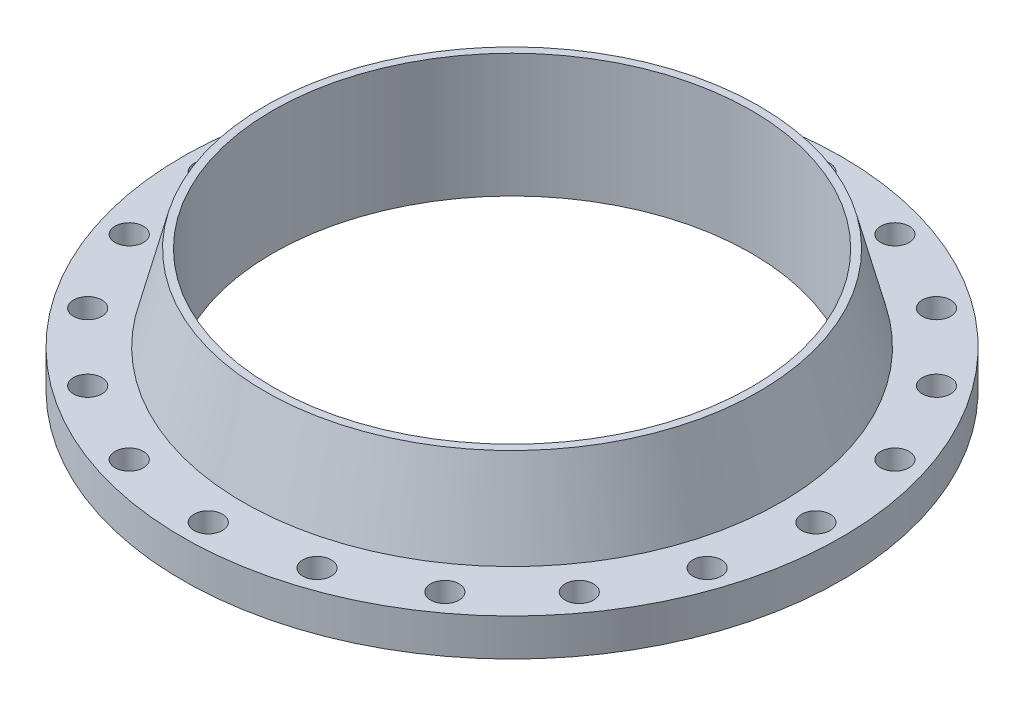
ISO-10303-21;
HEADER;
FILE_DESCRIPTION(('STEP AP214'),'2;1');
FILE_NAME('part.step','',(''),(''),'','','');
FILE_SCHEMA(('AUTOMOTIVE_DESIGN { 1 0 10303 214 1 1 1 1 }'));
ENDSEC;
DATA;
#1=APPLICATION_CONTEXT('core data for automotive mechanical design processes');
#2=APPLICATION_PROTOCOL_DEFINITION('international standard','automotive_design',2000,#1);
#3=PRODUCT_CONTEXT('',#1,'mechanical');
#4=PRODUCT('Part','Part','',(#3));
#5=PRODUCT_RELATED_PRODUCT_CATEGORY('part','',(#4));
#6=PRODUCT_DEFINITION_FORMATION('','',#4);
#7=PRODUCT_DEFINITION_CONTEXT('part definition',#1,'design');
#8=PRODUCT_DEFINITION('design','',#6,#7);
#9=PRODUCT_DEFINITION_SHAPE('','',#8);
#10=(LENGTH_UNIT() NAMED_UNIT(*) SI_UNIT(.MILLI.,.METRE.));
#11=(NAMED_UNIT(*) PLANE_ANGLE_UNIT() SI_UNIT($,.RADIAN.));
#12=(NAMED_UNIT(*) SI_UNIT($,.STERADIAN.) SOLID_ANGLE_UNIT());
#13=UNCERTAINTY_MEASURE_WITH_UNIT(LENGTH_MEASURE(1.E-05),#10,'distance_accuracy_value','');
#14=(GEOMETRIC_REPRESENTATION_CONTEXT(3) GLOBAL_UNCERTAINTY_ASSIGNED_CONTEXT((#13)) GLOBAL_UNIT_ASSIGNED_CONTEXT((#10,
#11,#12)) REPRESENTATION_CONTEXT('',''));
#15=CARTESIAN_POINT('',(0.,0.,0.));
#16=DIRECTION('',(0.,0.,1.));
#17=DIRECTION('',(1.,0.,0.));
#18=AXIS2_PLACEMENT_3D('',#15,#16,#17);
#19=CARTESIAN_POINT('',(-295.275,-42.5532702018429,-1.07742661903022E-13));
#20=DIRECTION('',(0.,1.,0.));
#21=DIRECTION('',(0.,0.,1.));
#22=AXIS2_PLACEMENT_3D('',#19,#20,#21);
#23=PLANE('',#22);
#24=CARTESIAN_POINT('',(0.,-42.5532702018429,-1.07742661903022E-13));
#25=DIRECTION('',(0.,-1.,0.));
#26=DIRECTION('',(0.,0.,-1.));
#27=AXIS2_PLACEMENT_3D('',#24,#25,#26);
#28=CIRCLE('',#27,295.275);
#29=CARTESIAN_POINT('',(0.,-42.5532702018429,-295.275));
#30=VERTEX_POINT('',#29);
#31=EDGE_CURVE('E10',#30,#30,#28,.T.);
#32=ORIENTED_EDGE('',*,*,#31,.F.);
#33=EDGE_LOOP('',(#32));
#34=FACE_BOUND('',#33,.T.);
#35=CARTESIAN_POINT('',(0.,-42.5532702018429,-1.07742661903022E-13));
#36=DIRECTION('',(0.,-1.,0.));
#37=DIRECTION('',(0.,0.,-1.));
#38=AXIS2_PLACEMENT_3D('',#35,#36,#37);
#39=CIRCLE('',#38,346.075);
#40=CARTESIAN_POINT('',(0.,-42.5532702018429,-346.075));
#41=VERTEX_POINT('',#40);
#42=EDGE_CURVE('E41',#41,#41,#39,.T.);
#43=ORIENTED_EDGE('',*,*,#42,.T.);
#44=EDGE_LOOP('',(#43));
#45=FACE_BOUND('',#44,.T.);
#46=ADVANCED_FACE('F34',(#34,#45),#23,.F.);
#47=CARTESIAN_POINT('',(0.,-40.9657702018428,-1.07742661903022E-13));
#48=DIRECTION('',(0.,-1.,0.));
#49=DIRECTION('',(0.,0.,-1.));
#50=AXIS2_PLACEMENT_3D('',#47,#48,#49);
#51=CYLINDRICAL_SURFACE('',#50,346.075);
#52=ORIENTED_EDGE('',*,*,#42,.F.);
#53=EDGE_LOOP('',(#52));
#54=FACE_BOUND('',#53,.T.);
#55=CARTESIAN_POINT('',(0.,-40.9657702018429,-1.07742661903022E-13));
#56=DIRECTION('',(0.,-1.,0.));
#57=DIRECTION('',(0.,0.,-1.));
#58=AXIS2_PLACEMENT_3D('',#55,#56,#57);
#59=CIRCLE('',#58,346.075);
#60=CARTESIAN_POINT('',(0.,-40.9657702018429,-346.075));
#61=VERTEX_POINT('',#60);
#62=EDGE_CURVE('E46',#61,#61,#59,.T.);
#63=ORIENTED_EDGE('',*,*,#62,.T.);
#64=EDGE_LOOP('',(#63));
#65=FACE_BOUND('',#64,.T.);
#66=ADVANCED_FACE('F136',(#54,#65),#51,.T.);
#67=CARTESIAN_POINT('',(-346.075,-40.9657702018429,-1.07742661903022E-13));
#68=DIRECTION('',(0.,1.,0.));
#69=DIRECTION('',(0.,0.,1.));
#70=AXIS2_PLACEMENT_3D('',#67,#68,#69);
#71=PLANE('',#70);
#72=CARTESIAN_POINT('',(220.213744771376,-40.9657702018428,-303.098216942574));
#73=DIRECTION('',(0.,1.,0.));
#74=DIRECTION('',(-0.587785252292474,0.,0.809016994374947));
#75=AXIS2_PLACEMENT_3D('',#72,#73,#74);
#76=CIRCLE('',#75,17.526);
#77=CARTESIAN_POINT('',(209.912220439698,-40.9657702018428,-288.919385099159));
#78=VERTEX_POINT('',#77);
#79=EDGE_CURVE('E416',#78,#78,#76,.T.);
#80=ORIENTED_EDGE('',*,*,#79,.T.);
#81=EDGE_LOOP('',(#80));
#82=FACE_BOUND('',#81,.T.);
#83=CARTESIAN_POINT('',(303.098216942574,-40.9657702018428,-220.213744771374));
#84=DIRECTION('',(0.,1.,0.));
#85=DIRECTION('',(-0.809016994374949,0.,0.587785252292471));
#86=AXIS2_PLACEMENT_3D('',#83,#84,#85);
#87=CIRCLE('',#86,17.526);
#88=CARTESIAN_POINT('',(288.919385099159,-40.9657702018428,-209.912220439697));
#89=VERTEX_POINT('',#88);
#90=EDGE_CURVE('E417',#89,#89,#87,.T.);
#91=ORIENTED_EDGE('',*,*,#90,.T.);
#92=EDGE_LOOP('',(#91));
#93=FACE_BOUND('',#92,.T.);
#94=CARTESIAN_POINT('',(356.31332382998,-40.9657702018428,-115.773216942573));
#95=DIRECTION('',(0.,1.,0.));
#96=DIRECTION('',(-0.951056516295155,0.,0.309016994374945));
#97=AXIS2_PLACEMENT_3D('',#94,#95,#96);
#98=CIRCLE('',#97,17.526);
#99=CARTESIAN_POINT('',(339.645107325391,-40.9657702018428,-110.357385099158));
#100=VERTEX_POINT('',#99);
#101=EDGE_CURVE('E421',#100,#100,#98,.T.);
#102=ORIENTED_EDGE('',*,*,#101,.T.);
#103=EDGE_LOOP('',(#102));
#104=FACE_BOUND('',#103,.T.);
#105=CARTESIAN_POINT('',(374.65,-40.9657702018428,1.20034082169456E-12));
#106=DIRECTION('',(0.,1.,0.));
#107=DIRECTION('',(-1.,0.,0.));
#108=AXIS2_PLACEMENT_3D('',#105,#106,#107);
#109=CIRCLE('',#108,17.526);
#110=CARTESIAN_POINT('',(357.124,-40.9657702018428,1.13914911974999E-12));
#111=VERTEX_POINT('',#110);
#112=EDGE_CURVE('E429',#111,#111,#109,.T.);
#113=ORIENTED_EDGE('',*,*,#112,.T.);
#114=EDGE_LOOP('',(#113));
#115=FACE_BOUND('',#114,.T.);
#116=CARTESIAN_POINT('',(356.313323829979,-40.9657702018428,115.773216942576));
#117=DIRECTION('',(0.,1.,0.));
#118=DIRECTION('',(-0.951056516295152,0.,-0.309016994374952));
#119=AXIS2_PLACEMENT_3D('',#116,#117,#118);
#120=CIRCLE('',#119,17.526);
#121=CARTESIAN_POINT('',(339.64510732539,-40.9657702018428,110.35738509916));
#122=VERTEX_POINT('',#121);
#123=EDGE_CURVE('E432',#122,#122,#120,.T.);
#124=ORIENTED_EDGE('',*,*,#123,.T.);
#125=EDGE_LOOP('',(#124));
#126=FACE_BOUND('',#125,.T.);
#127=CARTESIAN_POINT('',(303.098216942573,-40.9657702018428,220.213744771376));
#128=DIRECTION('',(0.,1.,0.));
#129=DIRECTION('',(-0.809016994374945,0.,-0.587785252292477));
#130=AXIS2_PLACEMENT_3D('',#127,#128,#129);
#131=CIRCLE('',#130,17.526);
#132=CARTESIAN_POINT('',(288.919385099158,-40.9657702018428,209.912220439698));
#133=VERTEX_POINT('',#132);
#134=EDGE_CURVE('E435',#133,#133,#131,.T.);
#135=ORIENTED_EDGE('',*,*,#134,.T.);
#136=EDGE_LOOP('',(#135));
#137=FACE_BOUND('',#136,.T.);
#138=CARTESIAN_POINT('',(220.213744771373,-40.9657702018428,303.098216942575));
#139=DIRECTION('',(0.,1.,0.));
#140=DIRECTION('',(-0.587785252292469,0.,-0.809016994374951));
#141=AXIS2_PLACEMENT_3D('',#138,#139,#140);
#142=CIRCLE('',#141,17.526);
#143=CARTESIAN_POINT('',(209.912220439696,-40.9657702018428,288.91938509916));
#144=VERTEX_POINT('',#143);
#145=EDGE_CURVE('E438',#144,#144,#142,.T.);
#146=ORIENTED_EDGE('',*,*,#145,.T.);
#147=EDGE_LOOP('',(#146));
#148=FACE_BOUND('',#147,.T.);
#149=CARTESIAN_POINT('',(115.773216942572,-40.9657702018428,356.31332382998));
#150=DIRECTION('',(0.,1.,0.));
#151=DIRECTION('',(-0.309016994374941,0.,-0.951056516295156));
#152=AXIS2_PLACEMENT_3D('',#149,#150,#151);
#153=CIRCLE('',#152,17.526);
#154=CARTESIAN_POINT('',(110.357385099156,-40.9657702018428,339.645107325391));
#155=VERTEX_POINT('',#154);
#156=EDGE_CURVE('E441',#155,#155,#153,.T.);
#157=ORIENTED_EDGE('',*,*,#156,.T.);
#158=EDGE_LOOP('',(#157));
#159=FACE_BOUND('',#158,.T.);
#160=CARTESIAN_POINT('',(0.,-40.9657702018428,374.65));
#161=DIRECTION('',(0.,1.,0.));
#162=DIRECTION('',(0.,0.,-1.));
#163=AXIS2_PLACEMENT_3D('',#160,#161,#162);
#164=CIRCLE('',#163,17.526);
#165=CARTESIAN_POINT('',(0.,-40.9657702018428,357.124));
#166=VERTEX_POINT('',#165);
#167=EDGE_CURVE('E444',#166,#166,#164,.T.);
#168=ORIENTED_EDGE('',*,*,#167,.T.);
#169=EDGE_LOOP('',(#168));
#170=FACE_BOUND('',#169,.T.);
#171=CARTESIAN_POINT('',(-115.773216942577,-40.9657702018428,356.313323829978));
#172=DIRECTION('',(0.,1.,0.));
#173=DIRECTION('',(0.309016994374955,0.,-0.951056516295151));
#174=AXIS2_PLACEMENT_3D('',#171,#172,#173);
#175=CIRCLE('',#174,17.526);
#176=CARTESIAN_POINT('',(-110.357385099161,-40.9657702018428,339.645107325389));
#177=VERTEX_POINT('',#176);
#178=EDGE_CURVE('E447',#177,#177,#175,.T.);
#179=ORIENTED_EDGE('',*,*,#178,.T.);
#180=EDGE_LOOP('',(#179));
#181=FACE_BOUND('',#180,.T.);
#182=CARTESIAN_POINT('',(-220.213744771378,-40.9657702018428,303.098216942572));
#183=DIRECTION('',(0.,1.,0.));
#184=DIRECTION('',(0.58778525229248,0.,-0.809016994374942));
#185=AXIS2_PLACEMENT_3D('',#182,#183,#184);
#186=CIRCLE('',#185,17.526);
#187=CARTESIAN_POINT('',(-209.9122204397,-40.9657702018428,288.919385099157));
#188=VERTEX_POINT('',#187);
#189=EDGE_CURVE('E450',#188,#188,#186,.T.);
#190=ORIENTED_EDGE('',*,*,#189,.T.);
#191=EDGE_LOOP('',(#190));
#192=FACE_BOUND('',#191,.T.);
#193=CARTESIAN_POINT('',(-303.098216942576,-40.9657702018428,220.213744771372));
#194=DIRECTION('',(0.,1.,0.));
#195=DIRECTION('',(0.809016994374953,0.,-0.587785252292465));
#196=AXIS2_PLACEMENT_3D('',#193,#194,#195);
#197=CIRCLE('',#196,17.526);
#198=CARTESIAN_POINT('',(-288.919385099161,-40.9657702018428,209.912220439694));
#199=VERTEX_POINT('',#198);
#200=EDGE_CURVE('E453',#199,#199,#197,.T.);
#201=ORIENTED_EDGE('',*,*,#200,.T.);
#202=EDGE_LOOP('',(#201));
#203=FACE_BOUND('',#202,.T.);
#204=CARTESIAN_POINT('',(-356.31332382998,-40.9657702018428,115.77321694257));
#205=DIRECTION('',(0.,1.,0.));
#206=DIRECTION('',(0.951056516295157,0.,-0.309016994374938));
#207=AXIS2_PLACEMENT_3D('',#204,#205,#206);
#208=CIRCLE('',#207,17.526);
#209=CARTESIAN_POINT('',(-339.645107325392,-40.9657702018428,110.357385099155));
#210=VERTEX_POINT('',#209);
#211=EDGE_CURVE('E456',#210,#210,#208,.T.);
#212=ORIENTED_EDGE('',*,*,#211,.T.);
#213=EDGE_LOOP('',(#212));
#214=FACE_BOUND('',#213,.T.);
#215=CARTESIAN_POINT('',(-374.65,-40.9657702018428,-4.03199311269576E-12));
#216=DIRECTION('',(0.,1.,0.));
#217=DIRECTION('',(1.,0.,0.));
#218=AXIS2_PLACEMENT_3D('',#215,#216,#217);
#219=CIRCLE('',#218,17.526);
#220=CARTESIAN_POINT('',(-357.124,-40.9657702018428,-3.84841800686207E-12));
#221=VERTEX_POINT('',#220);
#222=EDGE_CURVE('E459',#221,#221,#219,.T.);
#223=ORIENTED_EDGE('',*,*,#222,.T.);
#224=EDGE_LOOP('',(#223));
#225=FACE_BOUND('',#224,.T.);
#226=CARTESIAN_POINT('',(-356.313323829978,-40.9657702018428,-115.773216942578));
#227=DIRECTION('',(0.,1.,0.));
#228=DIRECTION('',(0.95105651629515,0.,0.309016994374958));
#229=AXIS2_PLACEMENT_3D('',#226,#227,#228);
#230=CIRCLE('',#229,17.526);
#231=CARTESIAN_POINT('',(-339.645107325389,-40.9657702018428,-110.357385099163));
#232=VERTEX_POINT('',#231);
#233=EDGE_CURVE('E462',#232,#232,#230,.T.);
#234=ORIENTED_EDGE('',*,*,#233,.T.);
#235=EDGE_LOOP('',(#234));
#236=FACE_BOUND('',#235,.T.);
#237=CARTESIAN_POINT('',(-303.098216942571,-40.9657702018428,-220.213744771379));
#238=DIRECTION('',(0.,1.,0.));
#239=DIRECTION('',(0.80901699437494,0.,0.587785252292483));
#240=AXIS2_PLACEMENT_3D('',#237,#238,#239);
#241=CIRCLE('',#240,17.526);
#242=CARTESIAN_POINT('',(-288.919385099156,-40.9657702018428,-209.912220439701));
#243=VERTEX_POINT('',#242);
#244=EDGE_CURVE('E464',#243,#243,#241,.T.);
#245=ORIENTED_EDGE('',*,*,#244,.T.);
#246=EDGE_LOOP('',(#245));
#247=FACE_BOUND('',#246,.T.);
#248=CARTESIAN_POINT('',(-220.213744771371,-40.9657702018428,-303.098216942577));
#249=DIRECTION('',(0.,1.,0.));
#250=DIRECTION('',(0.587785252292462,0.,0.809016994374955));
#251=AXIS2_PLACEMENT_3D('',#248,#249,#250);
#252=CIRCLE('',#251,17.526);
#253=CARTESIAN_POINT('',(-209.912220439693,-40.9657702018428,-288.919385099162));
#254=VERTEX_POINT('',#253);
#255=EDGE_CURVE('E466',#254,#254,#252,.T.);
#256=ORIENTED_EDGE('',*,*,#255,.T.);
#257=EDGE_LOOP('',(#256));
#258=FACE_BOUND('',#257,.T.);
#259=CARTESIAN_POINT('',(-115.773216942569,-40.9657702018428,-356.313323829981));
#260=DIRECTION('',(0.,1.,0.));
#261=DIRECTION('',(0.309016994374935,0.,0.951056516295158));
#262=AXIS2_PLACEMENT_3D('',#259,#260,#261);
#263=CIRCLE('',#262,17.526);
#264=CARTESIAN_POINT('',(-110.357385099154,-40.9657702018428,-339.645107325392));
#265=VERTEX_POINT('',#264);
#266=EDGE_CURVE('E424',#265,#265,#263,.T.);
#267=ORIENTED_EDGE('',*,*,#266,.T.);
#268=EDGE_LOOP('',(#267));
#269=FACE_BOUND('',#268,.T.);
#270=CARTESIAN_POINT('',(115.773216942574,-40.9657702018428,-356.313323829979));
#271=DIRECTION('',(0.,1.,0.));
#272=DIRECTION('',(-0.309016994374948,0.,0.951056516295154));
#273=AXIS2_PLACEMENT_3D('',#270,#271,#272);
#274=CIRCLE('',#273,17.526);
#275=CARTESIAN_POINT('',(110.357385099159,-40.9657702018428,-339.64510732539));
#276=VERTEX_POINT('',#275);
#277=EDGE_CURVE('E59',#276,#276,#274,.T.);
#278=ORIENTED_EDGE('',*,*,#277,.T.);
#279=EDGE_LOOP('',(#278));
#280=FACE_BOUND('',#279,.T.);
#281=CARTESIAN_POINT('',(0.,-40.9657702018428,-374.65));
#282=DIRECTION('',(0.,1.,0.));
#283=DIRECTION('',(0.,0.,1.));
#284=AXIS2_PLACEMENT_3D('',#281,#282,#283);
#285=CIRCLE('',#284,17.526);
#286=CARTESIAN_POINT('',(0.,-40.9657702018428,-357.124));
#287=VERTEX_POINT('',#286);
#288=EDGE_CURVE('E54',#287,#287,#285,.T.);
#289=ORIENTED_EDGE('',*,*,#288,.T.);
#290=EDGE_LOOP('',(#289));
#291=FACE_BOUND('',#290,.T.);
#292=ORIENTED_EDGE('',*,*,#62,.F.);
#293=EDGE_LOOP('',(#292));
#294=FACE_BOUND('',#293,.T.);
#295=CARTESIAN_POINT('',(0.,-40.9657702018429,-1.07742661903022E-13));
#296=DIRECTION('',(0.,-1.,0.));
#297=DIRECTION('',(0.,0.,-1.));
#298=AXIS2_PLACEMENT_3D('',#295,#296,#297);
#299=CIRCLE('',#298,406.4);
#300=CARTESIAN_POINT('',(0.,-40.9657702018429,-406.4));
#301=VERTEX_POINT('',#300);
#302=EDGE_CURVE('E131',#301,#301,#299,.T.);
#303=ORIENTED_EDGE('',*,*,#302,.T.);
#304=EDGE_LOOP('',(#303));
#305=FACE_BOUND('',#304,.T.);
#306=ADVANCED_FACE('F138',(#82,#93,#104,#115,#126,#137,#148,#159,#170,#181,#192,#203,#214,#225,
#236,#247,#258,#269,#280,#291,#294,#305),#71,.F.);
#307=CARTESIAN_POINT('',(0.,-40.9657702018428,-1.07742661903022E-13));
#308=DIRECTION('',(0.,-1.,0.));
#309=DIRECTION('',(0.,0.,-1.));
#310=AXIS2_PLACEMENT_3D('',#307,#308,#309);
#311=CYLINDRICAL_SURFACE('',#310,406.4);
#312=ORIENTED_EDGE('',*,*,#302,.F.);
#313=EDGE_LOOP('',(#312));
#314=FACE_BOUND('',#313,.T.);
#315=CARTESIAN_POINT('',(0.,5.00822979815712,-1.07742661903022E-13));
#316=DIRECTION('',(0.,-1.,0.));
#317=DIRECTION('',(0.,0.,-1.));
#318=AXIS2_PLACEMENT_3D('',#315,#316,#317);
#319=CIRCLE('',#318,406.4);
#320=CARTESIAN_POINT('',(0.,5.00822979815712,-406.4));
#321=VERTEX_POINT('',#320);
#322=EDGE_CURVE('E128',#321,#321,#319,.T.);
#323=ORIENTED_EDGE('',*,*,#322,.T.);
#324=EDGE_LOOP('',(#323));
#325=FACE_BOUND('',#324,.T.);
#326=ADVANCED_FACE('F141',(#314,#325),#311,.T.);
#327=CARTESIAN_POINT('',(-406.4,5.00822979815712,-1.07742661903022E-13));
#328=DIRECTION('',(0.,-1.,0.));
#329=DIRECTION('',(0.,0.,-1.));
#330=AXIS2_PLACEMENT_3D('',#327,#328,#329);
#331=PLANE('',#330);
#332=CARTESIAN_POINT('',(220.213744771376,5.00822979815713,-303.098216942574));
#333=DIRECTION('',(0.,-1.,0.));
#334=DIRECTION('',(0.,0.,-1.));
#335=AXIS2_PLACEMENT_3D('',#332,#333,#334);
#336=CIRCLE('',#335,17.526);
#337=CARTESIAN_POINT('',(220.213744771376,5.00822979815713,-320.624216942574));
#338=VERTEX_POINT('',#337);
#339=EDGE_CURVE('E37',#338,#338,#336,.F.);
#340=ORIENTED_EDGE('',*,*,#339,.F.);
#341=EDGE_LOOP('',(#340));
#342=FACE_BOUND('',#341,.T.);
#343=CARTESIAN_POINT('',(303.098216942574,5.00822979815713,-220.213744771374));
#344=DIRECTION('',(0.,-1.,0.));
#345=DIRECTION('',(0.,0.,-1.));
#346=AXIS2_PLACEMENT_3D('',#343,#344,#345);
#347=CIRCLE('',#346,17.526);
#348=CARTESIAN_POINT('',(303.098216942574,5.00822979815713,-237.739744771374));
#349=VERTEX_POINT('',#348);
#350=EDGE_CURVE('E106',#349,#349,#347,.F.);
#351=ORIENTED_EDGE('',*,*,#350,.F.);
#352=EDGE_LOOP('',(#351));
#353=FACE_BOUND('',#352,.T.);
#354=CARTESIAN_POINT('',(356.31332382998,5.00822979815713,-115.773216942573));
#355=DIRECTION('',(0.,-1.,0.));
#356=DIRECTION('',(0.,0.,-1.));
#357=AXIS2_PLACEMENT_3D('',#354,#355,#356);
#358=CIRCLE('',#357,17.526);
#359=CARTESIAN_POINT('',(356.31332382998,5.00822979815713,-133.299216942573));
#360=VERTEX_POINT('',#359);
#361=EDGE_CURVE('E104',#360,#360,#358,.F.);
#362=ORIENTED_EDGE('',*,*,#361,.F.);
#363=EDGE_LOOP('',(#362));
#364=FACE_BOUND('',#363,.T.);
#365=CARTESIAN_POINT('',(374.65,5.00822979815713,1.20034082169456E-12));
#366=DIRECTION('',(0.,-1.,0.));
#367=DIRECTION('',(0.,0.,-1.));
#368=AXIS2_PLACEMENT_3D('',#365,#366,#367);
#369=CIRCLE('',#368,17.526);
#370=CARTESIAN_POINT('',(374.65,5.00822979815713,-17.5259999999988));
#371=VERTEX_POINT('',#370);
#372=EDGE_CURVE('E101',#371,#371,#369,.F.);
#373=ORIENTED_EDGE('',*,*,#372,.F.);
#374=EDGE_LOOP('',(#373));
#375=FACE_BOUND('',#374,.T.);
#376=CARTESIAN_POINT('',(356.313323829979,5.00822979815713,115.773216942576));
#377=DIRECTION('',(0.,-1.,0.));
#378=DIRECTION('',(0.,0.,-1.));
#379=AXIS2_PLACEMENT_3D('',#376,#377,#378);
#380=CIRCLE('',#379,17.526);
#381=CARTESIAN_POINT('',(356.313323829979,5.00822979815713,98.2472169425755));
#382=VERTEX_POINT('',#381);
#383=EDGE_CURVE('E98',#382,#382,#380,.F.);
#384=ORIENTED_EDGE('',*,*,#383,.F.);
#385=EDGE_LOOP('',(#384));
#386=FACE_BOUND('',#385,.T.);
#387=CARTESIAN_POINT('',(303.098216942573,5.00822979815713,220.213744771376));
#388=DIRECTION('',(0.,-1.,0.));
#389=DIRECTION('',(0.,0.,-1.));
#390=AXIS2_PLACEMENT_3D('',#387,#388,#389);
#391=CIRCLE('',#390,17.526);
#392=CARTESIAN_POINT('',(303.098216942573,5.00822979815713,202.687744771376));
#393=VERTEX_POINT('',#392);
#394=EDGE_CURVE('E95',#393,#393,#391,.F.);
#395=ORIENTED_EDGE('',*,*,#394,.F.);
#396=EDGE_LOOP('',(#395));
#397=FACE_BOUND('',#396,.T.);
#398=CARTESIAN_POINT('',(220.213744771373,5.00822979815713,303.098216942575));
#399=DIRECTION('',(0.,-1.,0.));
#400=DIRECTION('',(0.,0.,-1.));
#401=AXIS2_PLACEMENT_3D('',#398,#399,#400);
#402=CIRCLE('',#401,17.526);
#403=CARTESIAN_POINT('',(220.213744771373,5.00822979815713,285.572216942575));
#404=VERTEX_POINT('',#403);
#405=EDGE_CURVE('E92',#404,#404,#402,.F.);
#406=ORIENTED_EDGE('',*,*,#405,.F.);
#407=EDGE_LOOP('',(#406));
#408=FACE_BOUND('',#407,.T.);
#409=CARTESIAN_POINT('',(115.773216942572,5.00822979815713,356.31332382998));
#410=DIRECTION('',(0.,-1.,0.));
#411=DIRECTION('',(0.,0.,-1.));
#412=AXIS2_PLACEMENT_3D('',#409,#410,#411);
#413=CIRCLE('',#412,17.526);
#414=CARTESIAN_POINT('',(115.773216942572,5.00822979815713,338.78732382998));
#415=VERTEX_POINT('',#414);
#416=EDGE_CURVE('E89',#415,#415,#413,.F.);
#417=ORIENTED_EDGE('',*,*,#416,.F.);
#418=EDGE_LOOP('',(#417));
#419=FACE_BOUND('',#418,.T.);
#420=CARTESIAN_POINT('',(0.,5.00822979815713,374.65));
#421=DIRECTION('',(0.,-1.,0.));
#422=DIRECTION('',(0.,0.,-1.));
#423=AXIS2_PLACEMENT_3D('',#420,#421,#422);
#424=CIRCLE('',#423,17.526);
#425=CARTESIAN_POINT('',(0.,5.00822979815713,357.124));
#426=VERTEX_POINT('',#425);
#427=EDGE_CURVE('E86',#426,#426,#424,.F.);
#428=ORIENTED_EDGE('',*,*,#427,.F.);
#429=EDGE_LOOP('',(#428));
#430=FACE_BOUND('',#429,.T.);
#431=CARTESIAN_POINT('',(-115.773216942577,5.00822979815713,356.313323829978));
#432=DIRECTION('',(0.,-1.,0.));
#433=DIRECTION('',(0.,0.,-1.));
#434=AXIS2_PLACEMENT_3D('',#431,#432,#433);
#435=CIRCLE('',#434,17.526);
#436=CARTESIAN_POINT('',(-115.773216942577,5.00822979815713,338.787323829978));
#437=VERTEX_POINT('',#436);
#438=EDGE_CURVE('E83',#437,#437,#435,.F.);
#439=ORIENTED_EDGE('',*,*,#438,.F.);
#440=EDGE_LOOP('',(#439));
#441=FACE_BOUND('',#440,.T.);
#442=CARTESIAN_POINT('',(-220.213744771378,5.00822979815713,303.098216942572));
#443=DIRECTION('',(0.,-1.,0.));
#444=DIRECTION('',(0.,0.,-1.));
#445=AXIS2_PLACEMENT_3D('',#442,#443,#444);
#446=CIRCLE('',#445,17.526);
#447=CARTESIAN_POINT('',(-220.213744771378,5.00822979815713,285.572216942572));
#448=VERTEX_POINT('',#447);
#449=EDGE_CURVE('E80',#448,#448,#446,.F.);
#450=ORIENTED_EDGE('',*,*,#449,.F.);
#451=EDGE_LOOP('',(#450));
#452=FACE_BOUND('',#451,.T.);
#453=CARTESIAN_POINT('',(-303.098216942576,5.00822979815713,220.213744771372));
#454=DIRECTION('',(0.,-1.,0.));
#455=DIRECTION('',(0.,0.,-1.));
#456=AXIS2_PLACEMENT_3D('',#453,#454,#455);
#457=CIRCLE('',#456,17.526);
#458=CARTESIAN_POINT('',(-303.098216942576,5.00822979815713,202.687744771372));
#459=VERTEX_POINT('',#458);
#460=EDGE_CURVE('E77',#459,#459,#457,.F.);
#461=ORIENTED_EDGE('',*,*,#460,.F.);
#462=EDGE_LOOP('',(#461));
#463=FACE_BOUND('',#462,.T.);
#464=CARTESIAN_POINT('',(-356.31332382998,5.00822979815713,115.77321694257));
#465=DIRECTION('',(0.,-1.,0.));
#466=DIRECTION('',(0.,0.,-1.));
#467=AXIS2_PLACEMENT_3D('',#464,#465,#466);
#468=CIRCLE('',#467,17.526);
#469=CARTESIAN_POINT('',(-356.31332382998,5.00822979815713,98.2472169425705));
#470=VERTEX_POINT('',#469);
#471=EDGE_CURVE('E74',#470,#470,#468,.F.);
#472=ORIENTED_EDGE('',*,*,#471,.F.);
#473=EDGE_LOOP('',(#472));
#474=FACE_BOUND('',#473,.T.);
#475=CARTESIAN_POINT('',(-374.65,5.00822979815713,-4.03199311269576E-12));
#476=DIRECTION('',(0.,-1.,0.));
#477=DIRECTION('',(0.,0.,-1.));
#478=AXIS2_PLACEMENT_3D('',#475,#476,#477);
#479=CIRCLE('',#478,17.526);
#480=CARTESIAN_POINT('',(-374.65,5.00822979815713,-17.526000000004));
#481=VERTEX_POINT('',#480);
#482=EDGE_CURVE('E71',#481,#481,#479,.F.);
#483=ORIENTED_EDGE('',*,*,#482,.F.);
#484=EDGE_LOOP('',(#483));
#485=FACE_BOUND('',#484,.T.);
#486=CARTESIAN_POINT('',(-356.313323829978,5.00822979815713,-115.773216942578));
#487=DIRECTION('',(0.,-1.,0.));
#488=DIRECTION('',(0.,0.,-1.));
#489=AXIS2_PLACEMENT_3D('',#486,#487,#488);
#490=CIRCLE('',#489,17.526);
#491=CARTESIAN_POINT('',(-356.313323829978,5.00822979815713,-133.299216942578));
#492=VERTEX_POINT('',#491);
#493=EDGE_CURVE('E68',#492,#492,#490,.F.);
#494=ORIENTED_EDGE('',*,*,#493,.F.);
#495=EDGE_LOOP('',(#494));
#496=FACE_BOUND('',#495,.T.);
#497=CARTESIAN_POINT('',(-303.098216942571,5.00822979815713,-220.213744771379));
#498=DIRECTION('',(0.,-1.,0.));
#499=DIRECTION('',(0.,0.,-1.));
#500=AXIS2_PLACEMENT_3D('',#497,#498,#499);
#501=CIRCLE('',#500,17.526);
#502=CARTESIAN_POINT('',(-303.098216942571,5.00822979815713,-237.739744771379));
#503=VERTEX_POINT('',#502);
#504=EDGE_CURVE('E65',#503,#503,#501,.F.);
#505=ORIENTED_EDGE('',*,*,#504,.F.);
#506=EDGE_LOOP('',(#505));
#507=FACE_BOUND('',#506,.T.);
#508=CARTESIAN_POINT('',(-220.213744771371,5.00822979815713,-303.098216942577));
#509=DIRECTION('',(0.,-1.,0.));
#510=DIRECTION('',(0.,0.,-1.));
#511=AXIS2_PLACEMENT_3D('',#508,#509,#510);
#512=CIRCLE('',#511,17.526);
#513=CARTESIAN_POINT('',(-220.213744771371,5.00822979815713,-320.624216942577));
#514=VERTEX_POINT('',#513);
#515=EDGE_CURVE('E62',#514,#514,#512,.F.);
#516=ORIENTED_EDGE('',*,*,#515,.F.);
#517=EDGE_LOOP('',(#516));
#518=FACE_BOUND('',#517,.T.);
#519=CARTESIAN_POINT('',(-115.773216942569,5.00822979815713,-356.313323829981));
#520=DIRECTION('',(0.,-1.,0.));
#521=DIRECTION('',(0.,0.,-1.));
#522=AXIS2_PLACEMENT_3D('',#519,#520,#521);
#523=CIRCLE('',#522,17.526);
#524=CARTESIAN_POINT('',(-115.773216942569,5.00822979815713,-373.839323829981));
#525=VERTEX_POINT('',#524);
#526=EDGE_CURVE('E58',#525,#525,#523,.F.);
#527=ORIENTED_EDGE('',*,*,#526,.F.);
#528=EDGE_LOOP('',(#527));
#529=FACE_BOUND('',#528,.T.);
#530=CARTESIAN_POINT('',(115.773216942574,5.00822979815713,-356.313323829979));
#531=DIRECTION('',(0.,-1.,0.));
#532=DIRECTION('',(0.,0.,-1.));
#533=AXIS2_PLACEMENT_3D('',#530,#531,#532);
#534=CIRCLE('',#533,17.526);
#535=CARTESIAN_POINT('',(115.773216942574,5.00822979815713,-373.839323829979));
#536=VERTEX_POINT('',#535);
#537=EDGE_CURVE('E55',#536,#536,#534,.F.);
#538=ORIENTED_EDGE('',*,*,#537,.F.);
#539=EDGE_LOOP('',(#538));
#540=FACE_BOUND('',#539,.T.);
#541=CARTESIAN_POINT('',(0.,5.00822979815713,-374.65));
#542=DIRECTION('',(0.,-1.,0.));
#543=DIRECTION('',(0.,0.,-1.));
#544=AXIS2_PLACEMENT_3D('',#541,#542,#543);
#545=CIRCLE('',#544,17.526);
#546=CARTESIAN_POINT('',(0.,5.00822979815713,-392.176));
#547=VERTEX_POINT('',#546);
#548=EDGE_CURVE('E50',#547,#547,#545,.F.);
#549=ORIENTED_EDGE('',*,*,#548,.F.);
#550=EDGE_LOOP('',(#549));
#551=FACE_BOUND('',#550,.T.);
#552=ORIENTED_EDGE('',*,*,#322,.F.);
#553=EDGE_LOOP('',(#552));
#554=FACE_BOUND('',#553,.T.);
#555=CARTESIAN_POINT('',(0.,5.00822979815712,-1.07742661903022E-13));
#556=DIRECTION('',(0.,-1.,0.));
#557=DIRECTION('',(0.,0.,-1.));
#558=AXIS2_PLACEMENT_3D('',#555,#556,#557);
#559=CIRCLE('',#558,331.724);
#560=CARTESIAN_POINT('',(0.,5.00822979815712,-331.724));
#561=VERTEX_POINT('',#560);
#562=EDGE_CURVE('E125',#561,#561,#559,.T.);
#563=ORIENTED_EDGE('',*,*,#562,.T.);
#564=EDGE_LOOP('',(#563));
#565=FACE_BOUND('',#564,.T.);
#566=ADVANCED_FACE('F148',(#342,#353,#364,#375,#386,#397,#408,#419,#430,#441,#452,#463,#474,
#485,#496,#507,#518,#529,#540,#551,#554,#565),#331,.F.);
#567=CARTESIAN_POINT('',(0.,109.910229798157,-1.07742661903022E-13));
#568=DIRECTION('',(0.,-1.,0.));
#569=DIRECTION('',(0.,0.,-1.));
#570=AXIS2_PLACEMENT_3D('',#567,#568,#569);
#571=CONICAL_SURFACE('',#570,304.8,0.251235691823183);
#572=ORIENTED_EDGE('',*,*,#562,.F.);
#573=EDGE_LOOP('',(#572));
#574=FACE_BOUND('',#573,.T.);
#575=CARTESIAN_POINT('',(0.,109.910229798157,-1.07742661903022E-13));
#576=DIRECTION('',(0.,-1.,0.));
#577=DIRECTION('',(0.,0.,-1.));
#578=AXIS2_PLACEMENT_3D('',#575,#576,#577);
#579=CIRCLE('',#578,304.8);
#580=CARTESIAN_POINT('',(0.,109.910229798157,-304.8));
#581=VERTEX_POINT('',#580);
#582=EDGE_CURVE('E122',#581,#581,#579,.T.);
#583=ORIENTED_EDGE('',*,*,#582,.T.);
#584=EDGE_LOOP('',(#583));
#585=FACE_BOUND('',#584,.T.);
#586=ADVANCED_FACE('F154',(#574,#585),#571,.T.);
#587=CARTESIAN_POINT('',(-304.8,109.910229798157,-1.07742661903022E-13));
#588=DIRECTION('',(0.,-1.,0.));
#589=DIRECTION('',(0.,0.,-1.));
#590=AXIS2_PLACEMENT_3D('',#587,#588,#589);
#591=PLANE('',#590);
#592=ORIENTED_EDGE('',*,*,#582,.F.);
#593=EDGE_LOOP('',(#592));
#594=FACE_BOUND('',#593,.T.);
#595=CARTESIAN_POINT('',(0.,109.910229798157,-1.07742661903022E-13));
#596=DIRECTION('',(0.,-1.,0.));
#597=DIRECTION('',(0.,0.,-1.));
#598=AXIS2_PLACEMENT_3D('',#595,#596,#597);
#599=CIRCLE('',#598,295.275);
#600=CARTESIAN_POINT('',(0.,109.910229798157,-295.275));
#601=VERTEX_POINT('',#600);
#602=EDGE_CURVE('E53',#601,#601,#599,.T.);
#603=ORIENTED_EDGE('',*,*,#602,.T.);
#604=EDGE_LOOP('',(#603));
#605=FACE_BOUND('',#604,.T.);
#606=ADVANCED_FACE('F161',(#594,#605),#591,.F.);
#607=CARTESIAN_POINT('',(0.,-40.9657702018428,-1.07742661903022E-13));
#608=DIRECTION('',(0.,-1.,0.));
#609=DIRECTION('',(0.,0.,-1.));
#610=AXIS2_PLACEMENT_3D('',#607,#608,#609);
#611=CYLINDRICAL_SURFACE('',#610,295.275);
#612=ORIENTED_EDGE('',*,*,#602,.F.);
#613=EDGE_LOOP('',(#612));
#614=FACE_BOUND('',#613,.T.);
#615=ORIENTED_EDGE('',*,*,#31,.T.);
#616=EDGE_LOOP('',(#615));
#617=FACE_BOUND('',#616,.T.);
#618=ADVANCED_FACE('F167',(#614,#617),#611,.F.);
#619=CARTESIAN_POINT('',(0.,132.008229798157,-374.65));
#620=DIRECTION('',(0.,-1.,0.));
#621=DIRECTION('',(0.,0.,-1.));
#622=AXIS2_PLACEMENT_3D('',#619,#620,#621);
#623=CYLINDRICAL_SURFACE('',#622,17.526);
#624=ORIENTED_EDGE('',*,*,#288,.F.);
#625=EDGE_LOOP('',(#624));
#626=FACE_BOUND('',#625,.T.);
#627=ORIENTED_EDGE('',*,*,#548,.T.);
#628=EDGE_LOOP('',(#627));
#629=FACE_BOUND('',#628,.T.);
#630=ADVANCED_FACE('F172',(#626,#629),#623,.F.);
#631=CARTESIAN_POINT('',(115.773216942574,132.008229798157,-356.313323829979));
#632=DIRECTION('',(0.,-1.,0.));
#633=DIRECTION('',(0.,0.,-1.));
#634=AXIS2_PLACEMENT_3D('',#631,#632,#633);
#635=CYLINDRICAL_SURFACE('',#634,17.526);
#636=ORIENTED_EDGE('',*,*,#277,.F.);
#637=EDGE_LOOP('',(#636));
#638=FACE_BOUND('',#637,.T.);
#639=ORIENTED_EDGE('',*,*,#537,.T.);
#640=EDGE_LOOP('',(#639));
#641=FACE_BOUND('',#640,.T.);
#642=ADVANCED_FACE('F177',(#638,#641),#635,.F.);
#643=CARTESIAN_POINT('',(-115.773216942569,132.008229798157,-356.313323829981));
#644=DIRECTION('',(0.,-1.,0.));
#645=DIRECTION('',(0.,0.,-1.));
#646=AXIS2_PLACEMENT_3D('',#643,#644,#645);
#647=CYLINDRICAL_SURFACE('',#646,17.526);
#648=ORIENTED_EDGE('',*,*,#266,.F.);
#649=EDGE_LOOP('',(#648));
#650=FACE_BOUND('',#649,.T.);
#651=ORIENTED_EDGE('',*,*,#526,.T.);
#652=EDGE_LOOP('',(#651));
#653=FACE_BOUND('',#652,.T.);
#654=ADVANCED_FACE('F230',(#650,#653),#647,.F.);
#655=CARTESIAN_POINT('',(-220.213744771371,132.008229798157,-303.098216942577));
#656=DIRECTION('',(0.,-1.,0.));
#657=DIRECTION('',(0.,0.,-1.));
#658=AXIS2_PLACEMENT_3D('',#655,#656,#657);
#659=CYLINDRICAL_SURFACE('',#658,17.526);
#660=ORIENTED_EDGE('',*,*,#255,.F.);
#661=EDGE_LOOP('',(#660));
#662=FACE_BOUND('',#661,.T.);
#663=ORIENTED_EDGE('',*,*,#515,.T.);
#664=EDGE_LOOP('',(#663));
#665=FACE_BOUND('',#664,.T.);
#666=ADVANCED_FACE('F240',(#662,#665),#659,.F.);
#667=CARTESIAN_POINT('',(-303.098216942571,132.008229798157,-220.213744771379));
#668=DIRECTION('',(0.,-1.,0.));
#669=DIRECTION('',(0.,0.,-1.));
#670=AXIS2_PLACEMENT_3D('',#667,#668,#669);
#671=CYLINDRICAL_SURFACE('',#670,17.526);
#672=ORIENTED_EDGE('',*,*,#244,.F.);
#673=EDGE_LOOP('',(#672));
#674=FACE_BOUND('',#673,.T.);
#675=ORIENTED_EDGE('',*,*,#504,.T.);
#676=EDGE_LOOP('',(#675));
#677=FACE_BOUND('',#676,.T.);
#678=ADVANCED_FACE('F250',(#674,#677),#671,.F.);
#679=CARTESIAN_POINT('',(-356.313323829978,132.008229798157,-115.773216942578));
#680=DIRECTION('',(0.,-1.,0.));
#681=DIRECTION('',(0.,0.,-1.));
#682=AXIS2_PLACEMENT_3D('',#679,#680,#681);
#683=CYLINDRICAL_SURFACE('',#682,17.526);
#684=ORIENTED_EDGE('',*,*,#233,.F.);
#685=EDGE_LOOP('',(#684));
#686=FACE_BOUND('',#685,.T.);
#687=ORIENTED_EDGE('',*,*,#493,.T.);
#688=EDGE_LOOP('',(#687));
#689=FACE_BOUND('',#688,.T.);
#690=ADVANCED_FACE('F260',(#686,#689),#683,.F.);
#691=CARTESIAN_POINT('',(-374.65,132.008229798157,-4.03199311269576E-12));
#692=DIRECTION('',(0.,-1.,0.));
#693=DIRECTION('',(0.,0.,-1.));
#694=AXIS2_PLACEMENT_3D('',#691,#692,#693);
#695=CYLINDRICAL_SURFACE('',#694,17.526);
#696=ORIENTED_EDGE('',*,*,#222,.F.);
#697=EDGE_LOOP('',(#696));
#698=FACE_BOUND('',#697,.T.);
#699=ORIENTED_EDGE('',*,*,#482,.T.);
#700=EDGE_LOOP('',(#699));
#701=FACE_BOUND('',#700,.T.);
#702=ADVANCED_FACE('F270',(#698,#701),#695,.F.);
#703=CARTESIAN_POINT('',(-356.31332382998,132.008229798157,115.77321694257));
#704=DIRECTION('',(0.,-1.,0.));
#705=DIRECTION('',(0.,0.,-1.));
#706=AXIS2_PLACEMENT_3D('',#703,#704,#705);
#707=CYLINDRICAL_SURFACE('',#706,17.526);
#708=ORIENTED_EDGE('',*,*,#211,.F.);
#709=EDGE_LOOP('',(#708));
#710=FACE_BOUND('',#709,.T.);
#711=ORIENTED_EDGE('',*,*,#471,.T.);
#712=EDGE_LOOP('',(#711));
#713=FACE_BOUND('',#712,.T.);
#714=ADVANCED_FACE('F280',(#710,#713),#707,.F.);
#715=CARTESIAN_POINT('',(-303.098216942576,132.008229798157,220.213744771372));
#716=DIRECTION('',(0.,-1.,0.));
#717=DIRECTION('',(0.,0.,-1.));
#718=AXIS2_PLACEMENT_3D('',#715,#716,#717);
#719=CYLINDRICAL_SURFACE('',#718,17.526);
#720=ORIENTED_EDGE('',*,*,#200,.F.);
#721=EDGE_LOOP('',(#720));
#722=FACE_BOUND('',#721,.T.);
#723=ORIENTED_EDGE('',*,*,#460,.T.);
#724=EDGE_LOOP('',(#723));
#725=FACE_BOUND('',#724,.T.);
#726=ADVANCED_FACE('F290',(#722,#725),#719,.F.);
#727=CARTESIAN_POINT('',(-220.213744771378,132.008229798157,303.098216942572));
#728=DIRECTION('',(0.,-1.,0.));
#729=DIRECTION('',(0.,0.,-1.));
#730=AXIS2_PLACEMENT_3D('',#727,#728,#729);
#731=CYLINDRICAL_SURFACE('',#730,17.526);
#732=ORIENTED_EDGE('',*,*,#189,.F.);
#733=EDGE_LOOP('',(#732));
#734=FACE_BOUND('',#733,.T.);
#735=ORIENTED_EDGE('',*,*,#449,.T.);
#736=EDGE_LOOP('',(#735));
#737=FACE_BOUND('',#736,.T.);
#738=ADVANCED_FACE('F300',(#734,#737),#731,.F.);
#739=CARTESIAN_POINT('',(-115.773216942577,132.008229798157,356.313323829978));
#740=DIRECTION('',(0.,-1.,0.));
#741=DIRECTION('',(0.,0.,-1.));
#742=AXIS2_PLACEMENT_3D('',#739,#740,#741);
#743=CYLINDRICAL_SURFACE('',#742,17.526);
#744=ORIENTED_EDGE('',*,*,#178,.F.);
#745=EDGE_LOOP('',(#744));
#746=FACE_BOUND('',#745,.T.);
#747=ORIENTED_EDGE('',*,*,#438,.T.);
#748=EDGE_LOOP('',(#747));
#749=FACE_BOUND('',#748,.T.);
#750=ADVANCED_FACE('F310',(#746,#749),#743,.F.);
#751=CARTESIAN_POINT('',(0.,132.008229798157,374.65));
#752=DIRECTION('',(0.,-1.,0.));
#753=DIRECTION('',(0.,0.,-1.));
#754=AXIS2_PLACEMENT_3D('',#751,#752,#753);
#755=CYLINDRICAL_SURFACE('',#754,17.526);
#756=ORIENTED_EDGE('',*,*,#167,.F.);
#757=EDGE_LOOP('',(#756));
#758=FACE_BOUND('',#757,.T.);
#759=ORIENTED_EDGE('',*,*,#427,.T.);
#760=EDGE_LOOP('',(#759));
#761=FACE_BOUND('',#760,.T.);
#762=ADVANCED_FACE('F320',(#758,#761),#755,.F.);
#763=CARTESIAN_POINT('',(115.773216942572,132.008229798157,356.31332382998));
#764=DIRECTION('',(0.,-1.,0.));
#765=DIRECTION('',(0.,0.,-1.));
#766=AXIS2_PLACEMENT_3D('',#763,#764,#765);
#767=CYLINDRICAL_SURFACE('',#766,17.526);
#768=ORIENTED_EDGE('',*,*,#156,.F.);
#769=EDGE_LOOP('',(#768));
#770=FACE_BOUND('',#769,.T.);
#771=ORIENTED_EDGE('',*,*,#416,.T.);
#772=EDGE_LOOP('',(#771));
#773=FACE_BOUND('',#772,.T.);
#774=ADVANCED_FACE('F330',(#770,#773),#767,.F.);
#775=CARTESIAN_POINT('',(220.213744771373,132.008229798157,303.098216942575));
#776=DIRECTION('',(0.,-1.,0.));
#777=DIRECTION('',(0.,0.,-1.));
#778=AXIS2_PLACEMENT_3D('',#775,#776,#777);
#779=CYLINDRICAL_SURFACE('',#778,17.526);
#780=ORIENTED_EDGE('',*,*,#145,.F.);
#781=EDGE_LOOP('',(#780));
#782=FACE_BOUND('',#781,.T.);
#783=ORIENTED_EDGE('',*,*,#405,.T.);
#784=EDGE_LOOP('',(#783));
#785=FACE_BOUND('',#784,.T.);
#786=ADVANCED_FACE('F340',(#782,#785),#779,.F.);
#787=CARTESIAN_POINT('',(303.098216942573,132.008229798157,220.213744771376));
#788=DIRECTION('',(0.,-1.,0.));
#789=DIRECTION('',(0.,0.,-1.));
#790=AXIS2_PLACEMENT_3D('',#787,#788,#789);
#791=CYLINDRICAL_SURFACE('',#790,17.526);
#792=ORIENTED_EDGE('',*,*,#134,.F.);
#793=EDGE_LOOP('',(#792));
#794=FACE_BOUND('',#793,.T.);
#795=ORIENTED_EDGE('',*,*,#394,.T.);
#796=EDGE_LOOP('',(#795));
#797=FACE_BOUND('',#796,.T.);
#798=ADVANCED_FACE('F350',(#794,#797),#791,.F.);
#799=CARTESIAN_POINT('',(356.313323829979,132.008229798157,115.773216942576));
#800=DIRECTION('',(0.,-1.,0.));
#801=DIRECTION('',(0.,0.,-1.));
#802=AXIS2_PLACEMENT_3D('',#799,#800,#801);
#803=CYLINDRICAL_SURFACE('',#802,17.526);
#804=ORIENTED_EDGE('',*,*,#123,.F.);
#805=EDGE_LOOP('',(#804));
#806=FACE_BOUND('',#805,.T.);
#807=ORIENTED_EDGE('',*,*,#383,.T.);
#808=EDGE_LOOP('',(#807));
#809=FACE_BOUND('',#808,.T.);
#810=ADVANCED_FACE('F360',(#806,#809),#803,.F.);
#811=CARTESIAN_POINT('',(374.65,132.008229798157,1.20034082169456E-12));
#812=DIRECTION('',(0.,-1.,0.));
#813=DIRECTION('',(0.,0.,-1.));
#814=AXIS2_PLACEMENT_3D('',#811,#812,#813);
#815=CYLINDRICAL_SURFACE('',#814,17.526);
#816=ORIENTED_EDGE('',*,*,#112,.F.);
#817=EDGE_LOOP('',(#816));
#818=FACE_BOUND('',#817,.T.);
#819=ORIENTED_EDGE('',*,*,#372,.T.);
#820=EDGE_LOOP('',(#819));
#821=FACE_BOUND('',#820,.T.);
#822=ADVANCED_FACE('F370',(#818,#821),#815,.F.);
#823=CARTESIAN_POINT('',(356.31332382998,132.008229798157,-115.773216942573));
#824=DIRECTION('',(0.,-1.,0.));
#825=DIRECTION('',(0.,0.,-1.));
#826=AXIS2_PLACEMENT_3D('',#823,#824,#825);
#827=CYLINDRICAL_SURFACE('',#826,17.526);
#828=ORIENTED_EDGE('',*,*,#101,.F.);
#829=EDGE_LOOP('',(#828));
#830=FACE_BOUND('',#829,.T.);
#831=ORIENTED_EDGE('',*,*,#361,.T.);
#832=EDGE_LOOP('',(#831));
#833=FACE_BOUND('',#832,.T.);
#834=ADVANCED_FACE('F380',(#830,#833),#827,.F.);
#835=CARTESIAN_POINT('',(303.098216942574,132.008229798157,-220.213744771374));
#836=DIRECTION('',(0.,-1.,0.));
#837=DIRECTION('',(0.,0.,-1.));
#838=AXIS2_PLACEMENT_3D('',#835,#836,#837);
#839=CYLINDRICAL_SURFACE('',#838,17.526);
#840=ORIENTED_EDGE('',*,*,#90,.F.);
#841=EDGE_LOOP('',(#840));
#842=FACE_BOUND('',#841,.T.);
#843=ORIENTED_EDGE('',*,*,#350,.T.);
#844=EDGE_LOOP('',(#843));
#845=FACE_BOUND('',#844,.T.);
#846=ADVANCED_FACE('F390',(#842,#845),#839,.F.);
#847=CARTESIAN_POINT('',(220.213744771376,132.008229798157,-303.098216942574));
#848=DIRECTION('',(0.,-1.,0.));
#849=DIRECTION('',(0.,0.,-1.));
#850=AXIS2_PLACEMENT_3D('',#847,#848,#849);
#851=CYLINDRICAL_SURFACE('',#850,17.526);
#852=ORIENTED_EDGE('',*,*,#79,.F.);
#853=EDGE_LOOP('',(#852));
#854=FACE_BOUND('',#853,.T.);
#855=ORIENTED_EDGE('',*,*,#339,.T.);
#856=EDGE_LOOP('',(#855));
#857=FACE_BOUND('',#856,.T.);
#858=ADVANCED_FACE('F400',(#854,#857),#851,.F.);
#859=CLOSED_SHELL('',(#46,#66,#306,#326,#566,#586,#606,#618,#630,#642,#654,#666,#678,#690,#702,
#714,#726,#738,#750,#762,#774,#786,#798,#810,#822,#834,#846,#858));
#860=MANIFOLD_SOLID_BREP('B2',#859);
#861=ADVANCED_BREP_SHAPE_REPRESENTATION('',(#18,#860),#14);
#862=SHAPE_DEFINITION_REPRESENTATION(#9,#861);
ENDSEC;
END-ISO-10303-21;
